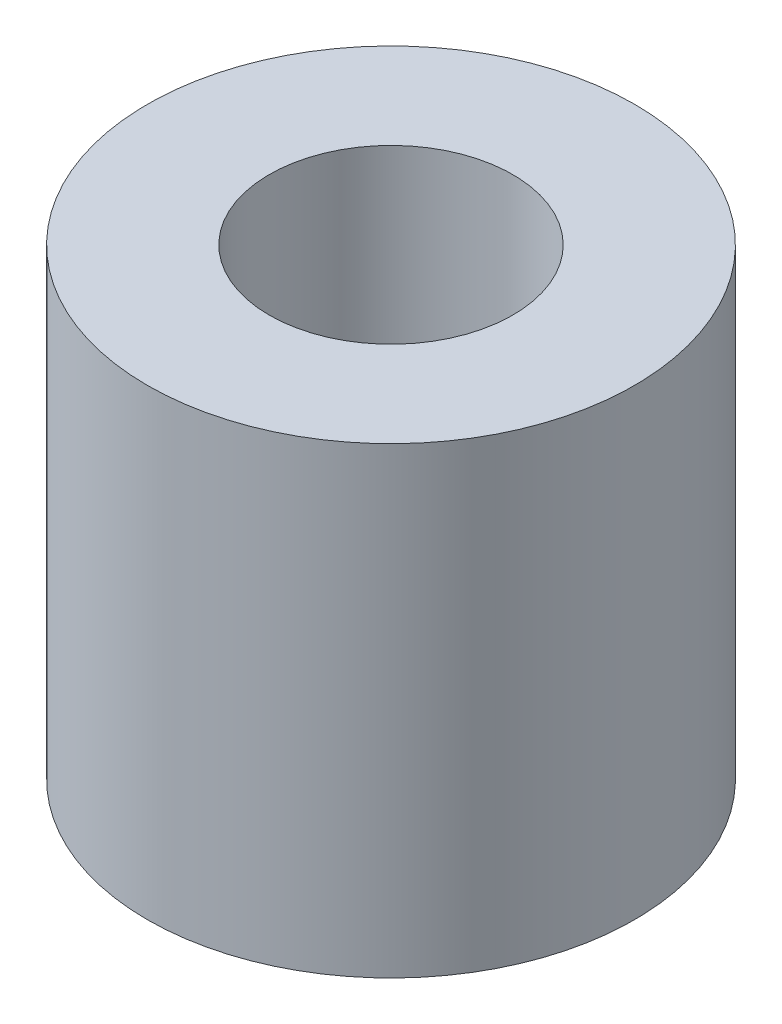
ISO-10303-21;
HEADER;
FILE_DESCRIPTION(('STEP AP214'),'2;1');
FILE_NAME('part.step','',(''),(''),'','','');
FILE_SCHEMA(('AUTOMOTIVE_DESIGN { 1 0 10303 214 1 1 1 1 }'));
ENDSEC;
DATA;
#1=APPLICATION_CONTEXT('core data for automotive mechanical design processes');
#2=APPLICATION_PROTOCOL_DEFINITION('international standard','automotive_design',2000,#1);
#3=PRODUCT_CONTEXT('',#1,'mechanical');
#4=PRODUCT('Part','Part','',(#3));
#5=PRODUCT_RELATED_PRODUCT_CATEGORY('part','',(#4));
#6=PRODUCT_DEFINITION_FORMATION('','',#4);
#7=PRODUCT_DEFINITION_CONTEXT('part definition',#1,'design');
#8=PRODUCT_DEFINITION('design','',#6,#7);
#9=PRODUCT_DEFINITION_SHAPE('','',#8);
#10=(LENGTH_UNIT() NAMED_UNIT(*) SI_UNIT(.MILLI.,.METRE.));
#11=(NAMED_UNIT(*) PLANE_ANGLE_UNIT() SI_UNIT($,.RADIAN.));
#12=(NAMED_UNIT(*) SI_UNIT($,.STERADIAN.) SOLID_ANGLE_UNIT());
#13=UNCERTAINTY_MEASURE_WITH_UNIT(LENGTH_MEASURE(1.E-05),#10,'distance_accuracy_value','');
#14=(GEOMETRIC_REPRESENTATION_CONTEXT(3) GLOBAL_UNCERTAINTY_ASSIGNED_CONTEXT((#13)) GLOBAL_UNIT_ASSIGNED_CONTEXT((#10,
#11,#12)) REPRESENTATION_CONTEXT('',''));
#15=CARTESIAN_POINT('',(0.,0.,0.));
#16=DIRECTION('',(0.,0.,1.));
#17=DIRECTION('',(1.,0.,0.));
#18=AXIS2_PLACEMENT_3D('',#15,#16,#17);
#19=CARTESIAN_POINT('',(0.,9.652,0.));
#20=DIRECTION('',(0.,1.,0.));
#21=DIRECTION('',(0.,0.,1.));
#22=AXIS2_PLACEMENT_3D('',#19,#20,#21);
#23=PLANE('',#22);
#24=CARTESIAN_POINT('',(0.,9.652,0.));
#25=DIRECTION('',(0.,1.,0.));
#26=DIRECTION('',(0.,0.,1.));
#27=AXIS2_PLACEMENT_3D('',#24,#25,#26);
#28=CIRCLE('',#27,5.08);
#29=CARTESIAN_POINT('',(0.,9.652,5.08));
#30=VERTEX_POINT('',#29);
#31=EDGE_CURVE('E12',#30,#30,#28,.T.);
#32=ORIENTED_EDGE('',*,*,#31,.T.);
#33=EDGE_LOOP('',(#32));
#34=FACE_BOUND('',#33,.T.);
#35=CARTESIAN_POINT('',(0.,9.652,0.));
#36=DIRECTION('',(0.,1.,0.));
#37=DIRECTION('',(0.,0.,1.));
#38=AXIS2_PLACEMENT_3D('',#35,#36,#37);
#39=CIRCLE('',#38,2.54);
#40=CARTESIAN_POINT('',(0.,9.652,2.54));
#41=VERTEX_POINT('',#40);
#42=EDGE_CURVE('E56',#41,#41,#39,.T.);
#43=ORIENTED_EDGE('',*,*,#42,.F.);
#44=EDGE_LOOP('',(#43));
#45=FACE_BOUND('',#44,.T.);
#46=ADVANCED_FACE('F45',(#34,#45),#23,.T.);
#47=CARTESIAN_POINT('',(0.,0.,0.));
#48=DIRECTION('',(0.,1.,0.));
#49=DIRECTION('',(0.,0.,1.));
#50=AXIS2_PLACEMENT_3D('',#47,#48,#49);
#51=PLANE('',#50);
#52=CARTESIAN_POINT('',(0.,0.,0.));
#53=DIRECTION('',(0.,1.,0.));
#54=DIRECTION('',(0.,0.,1.));
#55=AXIS2_PLACEMENT_3D('',#52,#53,#54);
#56=CIRCLE('',#55,5.08);
#57=CARTESIAN_POINT('',(0.,0.,5.08));
#58=VERTEX_POINT('',#57);
#59=EDGE_CURVE('E49',#58,#58,#56,.T.);
#60=ORIENTED_EDGE('',*,*,#59,.F.);
#61=EDGE_LOOP('',(#60));
#62=FACE_BOUND('',#61,.T.);
#63=CARTESIAN_POINT('',(0.,0.,0.));
#64=DIRECTION('',(0.,1.,0.));
#65=DIRECTION('',(0.,0.,1.));
#66=AXIS2_PLACEMENT_3D('',#63,#64,#65);
#67=CIRCLE('',#66,2.54);
#68=CARTESIAN_POINT('',(0.,0.,2.54));
#69=VERTEX_POINT('',#68);
#70=EDGE_CURVE('E58',#69,#69,#67,.T.);
#71=ORIENTED_EDGE('',*,*,#70,.T.);
#72=EDGE_LOOP('',(#71));
#73=FACE_BOUND('',#72,.T.);
#74=ADVANCED_FACE('F68',(#62,#73),#51,.F.);
#75=CARTESIAN_POINT('',(0.,9.652,0.));
#76=DIRECTION('',(0.,-1.,0.));
#77=DIRECTION('',(0.,0.,-1.));
#78=AXIS2_PLACEMENT_3D('',#75,#76,#77);
#79=CYLINDRICAL_SURFACE('',#78,5.08);
#80=ORIENTED_EDGE('',*,*,#31,.F.);
#81=EDGE_LOOP('',(#80));
#82=FACE_BOUND('',#81,.T.);
#83=ORIENTED_EDGE('',*,*,#59,.T.);
#84=EDGE_LOOP('',(#83));
#85=FACE_BOUND('',#84,.T.);
#86=ADVANCED_FACE('F47',(#82,#85),#79,.T.);
#87=CARTESIAN_POINT('',(0.,9.652,0.));
#88=DIRECTION('',(0.,-1.,0.));
#89=DIRECTION('',(0.,0.,-1.));
#90=AXIS2_PLACEMENT_3D('',#87,#88,#89);
#91=CYLINDRICAL_SURFACE('',#90,2.54);
#92=ORIENTED_EDGE('',*,*,#42,.T.);
#93=EDGE_LOOP('',(#92));
#94=FACE_BOUND('',#93,.T.);
#95=ORIENTED_EDGE('',*,*,#70,.F.);
#96=EDGE_LOOP('',(#95));
#97=FACE_BOUND('',#96,.T.);
#98=ADVANCED_FACE('F64',(#94,#97),#91,.F.);
#99=CLOSED_SHELL('',(#46,#74,#86,#98));
#100=MANIFOLD_SOLID_BREP('B2',#99);
#101=ADVANCED_BREP_SHAPE_REPRESENTATION('',(#18,#100),#14);
#102=SHAPE_DEFINITION_REPRESENTATION(#9,#101);
ENDSEC;
END-ISO-10303-21;
